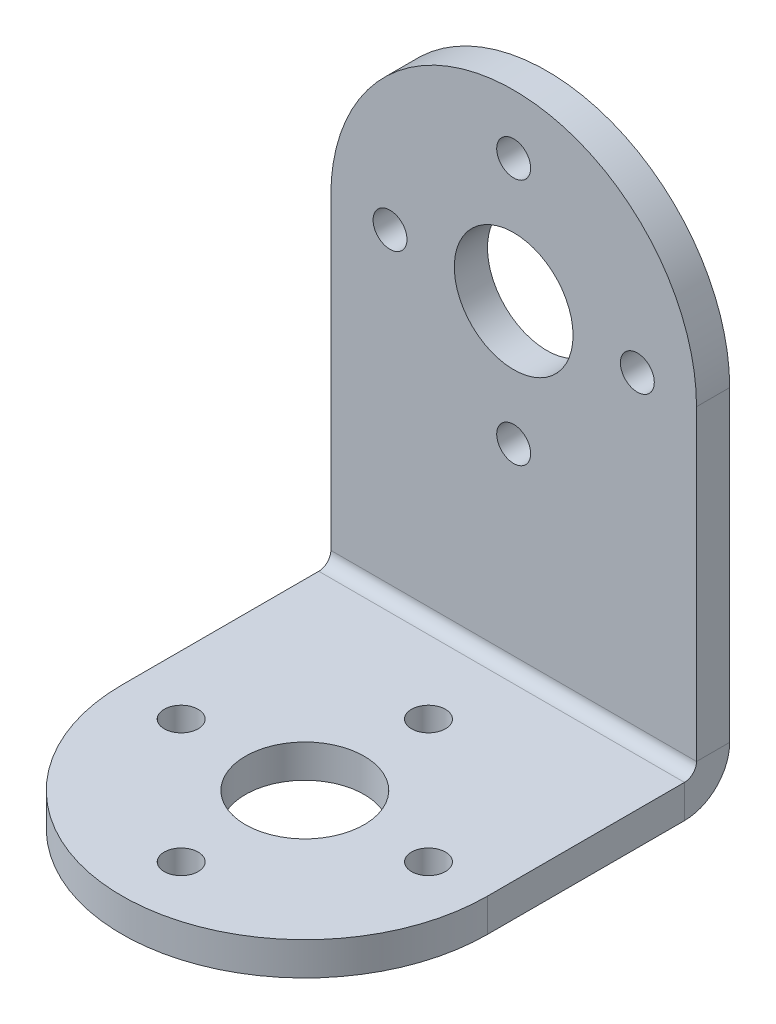
ISO-10303-21;
HEADER;
FILE_DESCRIPTION(('STEP AP214'),'2;1');
FILE_NAME('part.step','',(''),(''),'','','');
FILE_SCHEMA(('AUTOMOTIVE_DESIGN { 1 0 10303 214 1 1 1 1 }'));
ENDSEC;
DATA;
#1=APPLICATION_CONTEXT('core data for automotive mechanical design processes');
#2=APPLICATION_PROTOCOL_DEFINITION('international standard','automotive_design',2000,#1);
#3=PRODUCT_CONTEXT('',#1,'mechanical');
#4=PRODUCT('Part','Part','',(#3));
#5=PRODUCT_RELATED_PRODUCT_CATEGORY('part','',(#4));
#6=PRODUCT_DEFINITION_FORMATION('','',#4);
#7=PRODUCT_DEFINITION_CONTEXT('part definition',#1,'design');
#8=PRODUCT_DEFINITION('design','',#6,#7);
#9=PRODUCT_DEFINITION_SHAPE('','',#8);
#10=(LENGTH_UNIT() NAMED_UNIT(*) SI_UNIT(.MILLI.,.METRE.));
#11=(NAMED_UNIT(*) PLANE_ANGLE_UNIT() SI_UNIT($,.RADIAN.));
#12=(NAMED_UNIT(*) SI_UNIT($,.STERADIAN.) SOLID_ANGLE_UNIT());
#13=UNCERTAINTY_MEASURE_WITH_UNIT(LENGTH_MEASURE(1.E-05),#10,'distance_accuracy_value','');
#14=(GEOMETRIC_REPRESENTATION_CONTEXT(3) GLOBAL_UNCERTAINTY_ASSIGNED_CONTEXT((#13)) GLOBAL_UNIT_ASSIGNED_CONTEXT((#10,
#11,#12)) REPRESENTATION_CONTEXT('',''));
#15=CARTESIAN_POINT('',(0.,0.,0.));
#16=DIRECTION('',(0.,0.,1.));
#17=DIRECTION('',(1.,0.,0.));
#18=AXIS2_PLACEMENT_3D('',#15,#16,#17);
#19=CARTESIAN_POINT('',(0.,2.2352,16.3068));
#20=DIRECTION('',(0.,1.,0.));
#21=DIRECTION('',(0.,0.,1.));
#22=AXIS2_PLACEMENT_3D('',#19,#20,#21);
#23=CYLINDRICAL_SURFACE('',#22,12.319);
#24=DIRECTION('',(0.,1.,0.));
#25=VECTOR('',#24,1.);
#26=CARTESIAN_POINT('',(12.319,3.048,16.3068));
#27=LINE('',#26,#25);
#28=CARTESIAN_POINT('',(12.319,2.2352,16.3068));
#29=VERTEX_POINT('',#28);
#30=CARTESIAN_POINT('',(12.319,0.,16.3068));
#31=VERTEX_POINT('',#30);
#32=EDGE_CURVE('E136',#29,#31,#27,.F.);
#33=ORIENTED_EDGE('',*,*,#32,.F.);
#34=CARTESIAN_POINT('',(0.,2.2352,16.3068));
#35=DIRECTION('',(0.,-1.,0.));
#36=DIRECTION('',(0.,0.,-1.));
#37=AXIS2_PLACEMENT_3D('',#34,#35,#36);
#38=CIRCLE('',#37,12.319);
#39=CARTESIAN_POINT('',(-12.319,2.2352,16.3068));
#40=VERTEX_POINT('',#39);
#41=EDGE_CURVE('E50',#40,#29,#38,.F.);
#42=ORIENTED_EDGE('',*,*,#41,.F.);
#43=DIRECTION('',(0.,-1.,0.));
#44=VECTOR('',#43,1.);
#45=CARTESIAN_POINT('',(-12.319,2.2352,16.3068));
#46=LINE('',#45,#44);
#47=CARTESIAN_POINT('',(-12.319,0.,16.3068));
#48=VERTEX_POINT('',#47);
#49=EDGE_CURVE('E209',#48,#40,#46,.F.);
#50=ORIENTED_EDGE('',*,*,#49,.F.);
#51=CARTESIAN_POINT('',(0.,0.,16.3068));
#52=DIRECTION('',(0.,-1.,0.));
#53=DIRECTION('',(0.,0.,-1.));
#54=AXIS2_PLACEMENT_3D('',#51,#52,#53);
#55=CIRCLE('',#54,12.319);
#56=EDGE_CURVE('E11',#31,#48,#55,.T.);
#57=ORIENTED_EDGE('',*,*,#56,.F.);
#58=EDGE_LOOP('',(#33,#42,#50,#57));
#59=FACE_BOUND('',#58,.T.);
#60=ADVANCED_FACE('F42',(#59),#23,.T.);
#61=CARTESIAN_POINT('',(0.,23.749,0.));
#62=DIRECTION('',(0.,0.,-1.));
#63=DIRECTION('',(-1.,0.,0.));
#64=AXIS2_PLACEMENT_3D('',#61,#62,#63);
#65=CYLINDRICAL_SURFACE('',#64,12.319);
#66=DIRECTION('',(0.,0.,-1.));
#67=VECTOR('',#66,1.);
#68=CARTESIAN_POINT('',(12.319,23.749,3.048));
#69=LINE('',#68,#67);
#70=CARTESIAN_POINT('',(12.319,23.749,0.));
#71=VERTEX_POINT('',#70);
#72=CARTESIAN_POINT('',(12.319,23.749,2.2352));
#73=VERTEX_POINT('',#72);
#74=EDGE_CURVE('E118',#71,#73,#69,.F.);
#75=ORIENTED_EDGE('',*,*,#74,.F.);
#76=CARTESIAN_POINT('',(0.,23.749,0.));
#77=DIRECTION('',(0.,0.,-1.));
#78=DIRECTION('',(-1.,0.,0.));
#79=AXIS2_PLACEMENT_3D('',#76,#77,#78);
#80=CIRCLE('',#79,12.319);
#81=CARTESIAN_POINT('',(-12.319,23.749,0.));
#82=VERTEX_POINT('',#81);
#83=EDGE_CURVE('E201',#82,#71,#80,.T.);
#84=ORIENTED_EDGE('',*,*,#83,.F.);
#85=DIRECTION('',(0.,0.,-1.));
#86=VECTOR('',#85,1.);
#87=CARTESIAN_POINT('',(-12.319,23.749,3.048));
#88=LINE('',#87,#86);
#89=CARTESIAN_POINT('',(-12.319,23.749,2.2352));
#90=VERTEX_POINT('',#89);
#91=EDGE_CURVE('E197',#90,#82,#88,.T.);
#92=ORIENTED_EDGE('',*,*,#91,.F.);
#93=CARTESIAN_POINT('',(0.,23.749,2.2352));
#94=DIRECTION('',(0.,0.,-1.));
#95=DIRECTION('',(-1.,0.,0.));
#96=AXIS2_PLACEMENT_3D('',#93,#94,#95);
#97=CIRCLE('',#96,12.319);
#98=EDGE_CURVE('E204',#73,#90,#97,.F.);
#99=ORIENTED_EDGE('',*,*,#98,.F.);
#100=EDGE_LOOP('',(#75,#84,#92,#99));
#101=FACE_BOUND('',#100,.T.);
#102=ADVANCED_FACE('F337',(#101),#65,.T.);
#103=CARTESIAN_POINT('',(12.319,0.,3.048));
#104=DIRECTION('',(1.,0.,0.));
#105=DIRECTION('',(0.,0.,-1.));
#106=AXIS2_PLACEMENT_3D('',#103,#104,#105);
#107=PLANE('',#106);
#108=DIRECTION('',(0.,1.,0.));
#109=VECTOR('',#108,1.);
#110=CARTESIAN_POINT('',(12.319,0.,3.048));
#111=LINE('',#110,#109);
#112=CARTESIAN_POINT('',(12.319,0.,3.048));
#113=VERTEX_POINT('',#112);
#114=CARTESIAN_POINT('',(12.319,2.2352,3.048));
#115=VERTEX_POINT('',#114);
#116=EDGE_CURVE('E105',#113,#115,#111,.T.);
#117=ORIENTED_EDGE('',*,*,#116,.F.);
#118=CARTESIAN_POINT('',(12.319,3.048,3.048));
#119=DIRECTION('',(1.,0.,0.));
#120=DIRECTION('',(0.,0.,-1.));
#121=AXIS2_PLACEMENT_3D('',#118,#119,#120);
#122=CIRCLE('',#121,3.048);
#123=CARTESIAN_POINT('',(12.319,3.048,0.));
#124=VERTEX_POINT('',#123);
#125=EDGE_CURVE('E110',#124,#113,#122,.F.);
#126=ORIENTED_EDGE('',*,*,#125,.F.);
#127=DIRECTION('',(0.,0.,-1.));
#128=VECTOR('',#127,1.);
#129=CARTESIAN_POINT('',(12.319,3.048,2.2352));
#130=LINE('',#129,#128);
#131=CARTESIAN_POINT('',(12.319,3.048,2.2352));
#132=VERTEX_POINT('',#131);
#133=EDGE_CURVE('E119',#132,#124,#130,.T.);
#134=ORIENTED_EDGE('',*,*,#133,.F.);
#135=CARTESIAN_POINT('',(12.319,3.048,3.048));
#136=DIRECTION('',(1.,0.,0.));
#137=DIRECTION('',(0.,0.,-1.));
#138=AXIS2_PLACEMENT_3D('',#135,#136,#137);
#139=CIRCLE('',#138,0.8128);
#140=EDGE_CURVE('E112',#132,#115,#139,.F.);
#141=ORIENTED_EDGE('',*,*,#140,.T.);
#142=EDGE_LOOP('',(#117,#126,#134,#141));
#143=FACE_BOUND('',#142,.T.);
#144=ADVANCED_FACE('F107',(#143),#107,.T.);
#145=CARTESIAN_POINT('',(12.319,3.048,2.2352));
#146=DIRECTION('',(1.,0.,0.));
#147=DIRECTION('',(0.,0.,-1.));
#148=AXIS2_PLACEMENT_3D('',#145,#146,#147);
#149=PLANE('',#148);
#150=DIRECTION('',(0.,0.,1.));
#151=VECTOR('',#150,1.);
#152=CARTESIAN_POINT('',(12.319,2.2352,0.));
#153=LINE('',#152,#151);
#154=EDGE_CURVE('E138',#115,#29,#153,.T.);
#155=ORIENTED_EDGE('',*,*,#154,.T.);
#156=ORIENTED_EDGE('',*,*,#32,.T.);
#157=DIRECTION('',(0.,0.,1.));
#158=VECTOR('',#157,1.);
#159=CARTESIAN_POINT('',(12.319,0.,0.));
#160=LINE('',#159,#158);
#161=EDGE_CURVE('E124',#113,#31,#160,.T.);
#162=ORIENTED_EDGE('',*,*,#161,.F.);
#163=ORIENTED_EDGE('',*,*,#116,.T.);
#164=EDGE_LOOP('',(#155,#156,#162,#163));
#165=FACE_BOUND('',#164,.T.);
#166=ADVANCED_FACE('F135',(#165),#149,.T.);
#167=CARTESIAN_POINT('',(-12.319,3.048,0.));
#168=DIRECTION('',(-1.,0.,0.));
#169=DIRECTION('',(0.,0.,1.));
#170=AXIS2_PLACEMENT_3D('',#167,#168,#169);
#171=PLANE('',#170);
#172=DIRECTION('',(0.,0.,1.));
#173=VECTOR('',#172,1.);
#174=CARTESIAN_POINT('',(-12.319,3.048,0.));
#175=LINE('',#174,#173);
#176=CARTESIAN_POINT('',(-12.319,3.048,0.));
#177=VERTEX_POINT('',#176);
#178=CARTESIAN_POINT('',(-12.319,3.048,2.2352));
#179=VERTEX_POINT('',#178);
#180=EDGE_CURVE('E187',#177,#179,#175,.T.);
#181=ORIENTED_EDGE('',*,*,#180,.F.);
#182=CARTESIAN_POINT('',(-12.319,3.048,3.048));
#183=DIRECTION('',(1.,0.,0.));
#184=DIRECTION('',(0.,0.,-1.));
#185=AXIS2_PLACEMENT_3D('',#182,#183,#184);
#186=CIRCLE('',#185,3.048);
#187=CARTESIAN_POINT('',(-12.319,0.,3.048));
#188=VERTEX_POINT('',#187);
#189=EDGE_CURVE('E163',#177,#188,#186,.F.);
#190=ORIENTED_EDGE('',*,*,#189,.T.);
#191=DIRECTION('',(0.,-1.,0.));
#192=VECTOR('',#191,1.);
#193=CARTESIAN_POINT('',(-12.319,2.2352,3.048));
#194=LINE('',#193,#192);
#195=CARTESIAN_POINT('',(-12.319,2.2352,3.048));
#196=VERTEX_POINT('',#195);
#197=EDGE_CURVE('E131',#196,#188,#194,.T.);
#198=ORIENTED_EDGE('',*,*,#197,.F.);
#199=CARTESIAN_POINT('',(-12.319,3.048,3.048));
#200=DIRECTION('',(1.,0.,0.));
#201=DIRECTION('',(0.,0.,-1.));
#202=AXIS2_PLACEMENT_3D('',#199,#200,#201);
#203=CIRCLE('',#202,0.8128);
#204=EDGE_CURVE('E172',#179,#196,#203,.F.);
#205=ORIENTED_EDGE('',*,*,#204,.F.);
#206=EDGE_LOOP('',(#181,#190,#198,#205));
#207=FACE_BOUND('',#206,.T.);
#208=ADVANCED_FACE('F350',(#207),#171,.T.);
#209=CARTESIAN_POINT('',(-12.319,2.2352,3.048));
#210=DIRECTION('',(-1.,0.,0.));
#211=DIRECTION('',(0.,0.,1.));
#212=AXIS2_PLACEMENT_3D('',#209,#210,#211);
#213=PLANE('',#212);
#214=DIRECTION('',(0.,1.,0.));
#215=VECTOR('',#214,1.);
#216=CARTESIAN_POINT('',(-12.319,0.,2.2352));
#217=LINE('',#216,#215);
#218=EDGE_CURVE('E169',#90,#179,#217,.F.);
#219=ORIENTED_EDGE('',*,*,#218,.F.);
#220=ORIENTED_EDGE('',*,*,#91,.T.);
#221=DIRECTION('',(0.,-1.,0.));
#222=VECTOR('',#221,1.);
#223=CARTESIAN_POINT('',(-12.319,0.,0.));
#224=LINE('',#223,#222);
#225=EDGE_CURVE('E166',#82,#177,#224,.T.);
#226=ORIENTED_EDGE('',*,*,#225,.T.);
#227=ORIENTED_EDGE('',*,*,#180,.T.);
#228=EDGE_LOOP('',(#219,#220,#226,#227));
#229=FACE_BOUND('',#228,.T.);
#230=ADVANCED_FACE('F309',(#229),#213,.T.);
#231=CARTESIAN_POINT('',(12.319,2.2352,0.));
#232=DIRECTION('',(0.,-1.,0.));
#233=DIRECTION('',(0.,0.,-1.));
#234=AXIS2_PLACEMENT_3D('',#231,#232,#233);
#235=PLANE('',#234);
#236=CARTESIAN_POINT('',(-8.3312,2.2352,16.3068));
#237=DIRECTION('',(0.,1.,0.));
#238=DIRECTION('',(0.,0.,1.));
#239=AXIS2_PLACEMENT_3D('',#236,#237,#238);
#240=CIRCLE('',#239,1.143);
#241=CARTESIAN_POINT('',(-8.3312,2.2352,17.4498));
#242=VERTEX_POINT('',#241);
#243=EDGE_CURVE('E290',#242,#242,#240,.T.);
#244=ORIENTED_EDGE('',*,*,#243,.F.);
#245=EDGE_LOOP('',(#244));
#246=FACE_BOUND('',#245,.T.);
#247=CARTESIAN_POINT('',(0.,2.2352,24.638));
#248=DIRECTION('',(0.,1.,0.));
#249=DIRECTION('',(0.,0.,1.));
#250=AXIS2_PLACEMENT_3D('',#247,#248,#249);
#251=CIRCLE('',#250,1.143);
#252=CARTESIAN_POINT('',(0.,2.2352,25.781));
#253=VERTEX_POINT('',#252);
#254=EDGE_CURVE('E282',#253,#253,#251,.T.);
#255=ORIENTED_EDGE('',*,*,#254,.F.);
#256=EDGE_LOOP('',(#255));
#257=FACE_BOUND('',#256,.T.);
#258=CARTESIAN_POINT('',(8.3312,2.2352,16.3068));
#259=DIRECTION('',(0.,1.,0.));
#260=DIRECTION('',(0.,0.,1.));
#261=AXIS2_PLACEMENT_3D('',#258,#259,#260);
#262=CIRCLE('',#261,1.143);
#263=CARTESIAN_POINT('',(8.3312,2.2352,17.4498));
#264=VERTEX_POINT('',#263);
#265=EDGE_CURVE('E274',#264,#264,#262,.T.);
#266=ORIENTED_EDGE('',*,*,#265,.F.);
#267=EDGE_LOOP('',(#266));
#268=FACE_BOUND('',#267,.T.);
#269=CARTESIAN_POINT('',(0.,2.2352,7.9756));
#270=DIRECTION('',(0.,1.,0.));
#271=DIRECTION('',(0.,0.,1.));
#272=AXIS2_PLACEMENT_3D('',#269,#270,#271);
#273=CIRCLE('',#272,1.143);
#274=CARTESIAN_POINT('',(0.,2.2352,9.1186));
#275=VERTEX_POINT('',#274);
#276=EDGE_CURVE('E266',#275,#275,#273,.T.);
#277=ORIENTED_EDGE('',*,*,#276,.F.);
#278=EDGE_LOOP('',(#277));
#279=FACE_BOUND('',#278,.T.);
#280=CARTESIAN_POINT('',(0.,2.2352,16.3068));
#281=DIRECTION('',(0.,1.,0.));
#282=DIRECTION('',(0.,0.,1.));
#283=AXIS2_PLACEMENT_3D('',#280,#281,#282);
#284=CIRCLE('',#283,4.0005);
#285=CARTESIAN_POINT('',(0.,2.2352,20.3073));
#286=VERTEX_POINT('',#285);
#287=EDGE_CURVE('E258',#286,#286,#284,.T.);
#288=ORIENTED_EDGE('',*,*,#287,.F.);
#289=EDGE_LOOP('',(#288));
#290=FACE_BOUND('',#289,.T.);
#291=DIRECTION('',(0.,0.,1.));
#292=VECTOR('',#291,1.);
#293=CARTESIAN_POINT('',(-12.319,2.2352,0.));
#294=LINE('',#293,#292);
#295=EDGE_CURVE('E156',#196,#40,#294,.T.);
#296=ORIENTED_EDGE('',*,*,#295,.T.);
#297=ORIENTED_EDGE('',*,*,#41,.T.);
#298=ORIENTED_EDGE('',*,*,#154,.F.);
#299=DIRECTION('',(-1.,0.,0.));
#300=VECTOR('',#299,1.);
#301=CARTESIAN_POINT('',(12.319,2.2352,3.048));
#302=LINE('',#301,#300);
#303=EDGE_CURVE('E155',#115,#196,#302,.T.);
#304=ORIENTED_EDGE('',*,*,#303,.T.);
#305=EDGE_LOOP('',(#296,#297,#298,#304));
#306=FACE_BOUND('',#305,.T.);
#307=ADVANCED_FACE('F214',(#246,#257,#268,#279,#290,#306),#235,.F.);
#308=CARTESIAN_POINT('',(12.319,0.,0.));
#309=DIRECTION('',(0.,-1.,0.));
#310=DIRECTION('',(0.,0.,-1.));
#311=AXIS2_PLACEMENT_3D('',#308,#309,#310);
#312=PLANE('',#311);
#313=CARTESIAN_POINT('',(-8.3312,0.,16.3068));
#314=DIRECTION('',(0.,1.,0.));
#315=DIRECTION('',(0.,0.,1.));
#316=AXIS2_PLACEMENT_3D('',#313,#314,#315);
#317=CIRCLE('',#316,1.143);
#318=CARTESIAN_POINT('',(-8.3312,0.,17.4498));
#319=VERTEX_POINT('',#318);
#320=EDGE_CURVE('E286',#319,#319,#317,.T.);
#321=ORIENTED_EDGE('',*,*,#320,.T.);
#322=EDGE_LOOP('',(#321));
#323=FACE_BOUND('',#322,.T.);
#324=CARTESIAN_POINT('',(0.,0.,24.638));
#325=DIRECTION('',(0.,1.,0.));
#326=DIRECTION('',(0.,0.,1.));
#327=AXIS2_PLACEMENT_3D('',#324,#325,#326);
#328=CIRCLE('',#327,1.143);
#329=CARTESIAN_POINT('',(0.,0.,25.781));
#330=VERTEX_POINT('',#329);
#331=EDGE_CURVE('E278',#330,#330,#328,.T.);
#332=ORIENTED_EDGE('',*,*,#331,.T.);
#333=EDGE_LOOP('',(#332));
#334=FACE_BOUND('',#333,.T.);
#335=CARTESIAN_POINT('',(8.3312,0.,16.3068));
#336=DIRECTION('',(0.,1.,0.));
#337=DIRECTION('',(0.,0.,1.));
#338=AXIS2_PLACEMENT_3D('',#335,#336,#337);
#339=CIRCLE('',#338,1.143);
#340=CARTESIAN_POINT('',(8.3312,0.,17.4498));
#341=VERTEX_POINT('',#340);
#342=EDGE_CURVE('E270',#341,#341,#339,.T.);
#343=ORIENTED_EDGE('',*,*,#342,.T.);
#344=EDGE_LOOP('',(#343));
#345=FACE_BOUND('',#344,.T.);
#346=CARTESIAN_POINT('',(0.,0.,7.9756));
#347=DIRECTION('',(0.,1.,0.));
#348=DIRECTION('',(0.,0.,1.));
#349=AXIS2_PLACEMENT_3D('',#346,#347,#348);
#350=CIRCLE('',#349,1.143);
#351=CARTESIAN_POINT('',(0.,0.,9.1186));
#352=VERTEX_POINT('',#351);
#353=EDGE_CURVE('E262',#352,#352,#350,.T.);
#354=ORIENTED_EDGE('',*,*,#353,.T.);
#355=EDGE_LOOP('',(#354));
#356=FACE_BOUND('',#355,.T.);
#357=CARTESIAN_POINT('',(0.,0.,16.3068));
#358=DIRECTION('',(0.,1.,0.));
#359=DIRECTION('',(0.,0.,1.));
#360=AXIS2_PLACEMENT_3D('',#357,#358,#359);
#361=CIRCLE('',#360,4.0005);
#362=CARTESIAN_POINT('',(0.,0.,20.3073));
#363=VERTEX_POINT('',#362);
#364=EDGE_CURVE('E254',#363,#363,#361,.T.);
#365=ORIENTED_EDGE('',*,*,#364,.T.);
#366=EDGE_LOOP('',(#365));
#367=FACE_BOUND('',#366,.T.);
#368=ORIENTED_EDGE('',*,*,#161,.T.);
#369=ORIENTED_EDGE('',*,*,#56,.T.);
#370=DIRECTION('',(0.,0.,1.));
#371=VECTOR('',#370,1.);
#372=CARTESIAN_POINT('',(-12.319,0.,0.));
#373=LINE('',#372,#371);
#374=EDGE_CURVE('E126',#188,#48,#373,.T.);
#375=ORIENTED_EDGE('',*,*,#374,.F.);
#376=DIRECTION('',(-1.,0.,0.));
#377=VECTOR('',#376,1.);
#378=CARTESIAN_POINT('',(12.319,0.,3.048));
#379=LINE('',#378,#377);
#380=EDGE_CURVE('E122',#113,#188,#379,.T.);
#381=ORIENTED_EDGE('',*,*,#380,.F.);
#382=EDGE_LOOP('',(#368,#369,#375,#381));
#383=FACE_BOUND('',#382,.T.);
#384=ADVANCED_FACE('F123',(#323,#334,#345,#356,#367,#383),#312,.T.);
#385=CARTESIAN_POINT('',(12.319,3.048,3.048));
#386=DIRECTION('',(-1.,0.,0.));
#387=DIRECTION('',(0.,0.,1.));
#388=AXIS2_PLACEMENT_3D('',#385,#386,#387);
#389=CYLINDRICAL_SURFACE('',#388,3.048);
#390=ORIENTED_EDGE('',*,*,#189,.F.);
#391=DIRECTION('',(-1.,0.,0.));
#392=VECTOR('',#391,1.);
#393=CARTESIAN_POINT('',(12.319,3.048,0.));
#394=LINE('',#393,#392);
#395=EDGE_CURVE('E132',#124,#177,#394,.T.);
#396=ORIENTED_EDGE('',*,*,#395,.F.);
#397=ORIENTED_EDGE('',*,*,#125,.T.);
#398=ORIENTED_EDGE('',*,*,#380,.T.);
#399=EDGE_LOOP('',(#390,#396,#397,#398));
#400=FACE_BOUND('',#399,.T.);
#401=ADVANCED_FACE('F141',(#400),#389,.T.);
#402=CARTESIAN_POINT('',(12.319,0.,0.));
#403=DIRECTION('',(0.,0.,-1.));
#404=DIRECTION('',(-1.,0.,0.));
#405=AXIS2_PLACEMENT_3D('',#402,#403,#404);
#406=PLANE('',#405);
#407=CARTESIAN_POINT('',(-8.3312,23.749,0.));
#408=DIRECTION('',(0.,0.,1.));
#409=DIRECTION('',(1.,0.,0.));
#410=AXIS2_PLACEMENT_3D('',#407,#408,#409);
#411=CIRCLE('',#410,1.143);
#412=CARTESIAN_POINT('',(-7.1882,23.749,0.));
#413=VERTEX_POINT('',#412);
#414=EDGE_CURVE('E246',#413,#413,#411,.T.);
#415=ORIENTED_EDGE('',*,*,#414,.T.);
#416=EDGE_LOOP('',(#415));
#417=FACE_BOUND('',#416,.T.);
#418=CARTESIAN_POINT('',(0.,15.4178,0.));
#419=DIRECTION('',(0.,0.,1.));
#420=DIRECTION('',(1.,0.,0.));
#421=AXIS2_PLACEMENT_3D('',#418,#419,#420);
#422=CIRCLE('',#421,1.143);
#423=CARTESIAN_POINT('',(1.143,15.4178,0.));
#424=VERTEX_POINT('',#423);
#425=EDGE_CURVE('E238',#424,#424,#422,.T.);
#426=ORIENTED_EDGE('',*,*,#425,.T.);
#427=EDGE_LOOP('',(#426));
#428=FACE_BOUND('',#427,.T.);
#429=CARTESIAN_POINT('',(8.3312,23.749,0.));
#430=DIRECTION('',(0.,0.,1.));
#431=DIRECTION('',(1.,0.,0.));
#432=AXIS2_PLACEMENT_3D('',#429,#430,#431);
#433=CIRCLE('',#432,1.143);
#434=CARTESIAN_POINT('',(9.4742,23.749,0.));
#435=VERTEX_POINT('',#434);
#436=EDGE_CURVE('E230',#435,#435,#433,.T.);
#437=ORIENTED_EDGE('',*,*,#436,.T.);
#438=EDGE_LOOP('',(#437));
#439=FACE_BOUND('',#438,.T.);
#440=CARTESIAN_POINT('',(0.,32.0802,0.));
#441=DIRECTION('',(0.,0.,1.));
#442=DIRECTION('',(1.,0.,0.));
#443=AXIS2_PLACEMENT_3D('',#440,#441,#442);
#444=CIRCLE('',#443,1.143);
#445=CARTESIAN_POINT('',(1.143,32.0802,0.));
#446=VERTEX_POINT('',#445);
#447=EDGE_CURVE('E222',#446,#446,#444,.T.);
#448=ORIENTED_EDGE('',*,*,#447,.T.);
#449=EDGE_LOOP('',(#448));
#450=FACE_BOUND('',#449,.T.);
#451=CARTESIAN_POINT('',(0.,23.749,0.));
#452=DIRECTION('',(0.,0.,1.));
#453=DIRECTION('',(1.,0.,0.));
#454=AXIS2_PLACEMENT_3D('',#451,#452,#453);
#455=CIRCLE('',#454,4.0005);
#456=CARTESIAN_POINT('',(4.0005,23.749,0.));
#457=VERTEX_POINT('',#456);
#458=EDGE_CURVE('E160',#457,#457,#455,.T.);
#459=ORIENTED_EDGE('',*,*,#458,.T.);
#460=EDGE_LOOP('',(#459));
#461=FACE_BOUND('',#460,.T.);
#462=ORIENTED_EDGE('',*,*,#225,.F.);
#463=ORIENTED_EDGE('',*,*,#83,.T.);
#464=DIRECTION('',(0.,-1.,0.));
#465=VECTOR('',#464,1.);
#466=CARTESIAN_POINT('',(12.319,0.,0.));
#467=LINE('',#466,#465);
#468=EDGE_CURVE('E144',#71,#124,#467,.T.);
#469=ORIENTED_EDGE('',*,*,#468,.T.);
#470=ORIENTED_EDGE('',*,*,#395,.T.);
#471=EDGE_LOOP('',(#462,#463,#469,#470));
#472=FACE_BOUND('',#471,.T.);
#473=ADVANCED_FACE('F361',(#417,#428,#439,#450,#461,#472),#406,.T.);
#474=CARTESIAN_POINT('',(12.319,0.,2.2352));
#475=DIRECTION('',(0.,0.,-1.));
#476=DIRECTION('',(-1.,0.,0.));
#477=AXIS2_PLACEMENT_3D('',#474,#475,#476);
#478=PLANE('',#477);
#479=CARTESIAN_POINT('',(-8.3312,23.749,2.2352));
#480=DIRECTION('',(0.,0.,1.));
#481=DIRECTION('',(1.,0.,0.));
#482=AXIS2_PLACEMENT_3D('',#479,#480,#481);
#483=CIRCLE('',#482,1.143);
#484=CARTESIAN_POINT('',(-7.1882,23.749,2.2352));
#485=VERTEX_POINT('',#484);
#486=EDGE_CURVE('E250',#485,#485,#483,.T.);
#487=ORIENTED_EDGE('',*,*,#486,.F.);
#488=EDGE_LOOP('',(#487));
#489=FACE_BOUND('',#488,.T.);
#490=CARTESIAN_POINT('',(0.,15.4178,2.2352));
#491=DIRECTION('',(0.,0.,1.));
#492=DIRECTION('',(1.,0.,0.));
#493=AXIS2_PLACEMENT_3D('',#490,#491,#492);
#494=CIRCLE('',#493,1.143);
#495=CARTESIAN_POINT('',(1.143,15.4178,2.2352));
#496=VERTEX_POINT('',#495);
#497=EDGE_CURVE('E242',#496,#496,#494,.T.);
#498=ORIENTED_EDGE('',*,*,#497,.F.);
#499=EDGE_LOOP('',(#498));
#500=FACE_BOUND('',#499,.T.);
#501=CARTESIAN_POINT('',(8.3312,23.749,2.2352));
#502=DIRECTION('',(0.,0.,1.));
#503=DIRECTION('',(1.,0.,0.));
#504=AXIS2_PLACEMENT_3D('',#501,#502,#503);
#505=CIRCLE('',#504,1.143);
#506=CARTESIAN_POINT('',(9.4742,23.749,2.2352));
#507=VERTEX_POINT('',#506);
#508=EDGE_CURVE('E234',#507,#507,#505,.T.);
#509=ORIENTED_EDGE('',*,*,#508,.F.);
#510=EDGE_LOOP('',(#509));
#511=FACE_BOUND('',#510,.T.);
#512=CARTESIAN_POINT('',(0.,32.0802,2.2352));
#513=DIRECTION('',(0.,0.,1.));
#514=DIRECTION('',(1.,0.,0.));
#515=AXIS2_PLACEMENT_3D('',#512,#513,#514);
#516=CIRCLE('',#515,1.143);
#517=CARTESIAN_POINT('',(1.143,32.0802,2.2352));
#518=VERTEX_POINT('',#517);
#519=EDGE_CURVE('E226',#518,#518,#516,.T.);
#520=ORIENTED_EDGE('',*,*,#519,.F.);
#521=EDGE_LOOP('',(#520));
#522=FACE_BOUND('',#521,.T.);
#523=CARTESIAN_POINT('',(0.,23.749,2.2352));
#524=DIRECTION('',(0.,0.,1.));
#525=DIRECTION('',(1.,0.,0.));
#526=AXIS2_PLACEMENT_3D('',#523,#524,#525);
#527=CIRCLE('',#526,4.0005);
#528=CARTESIAN_POINT('',(4.0005,23.749,2.2352));
#529=VERTEX_POINT('',#528);
#530=EDGE_CURVE('E218',#529,#529,#527,.T.);
#531=ORIENTED_EDGE('',*,*,#530,.F.);
#532=EDGE_LOOP('',(#531));
#533=FACE_BOUND('',#532,.T.);
#534=DIRECTION('',(0.,1.,0.));
#535=VECTOR('',#534,1.);
#536=CARTESIAN_POINT('',(12.319,0.,2.2352));
#537=LINE('',#536,#535);
#538=EDGE_CURVE('E147',#73,#132,#537,.F.);
#539=ORIENTED_EDGE('',*,*,#538,.F.);
#540=ORIENTED_EDGE('',*,*,#98,.T.);
#541=ORIENTED_EDGE('',*,*,#218,.T.);
#542=DIRECTION('',(-1.,0.,0.));
#543=VECTOR('',#542,1.);
#544=CARTESIAN_POINT('',(12.319,3.048,2.2352));
#545=LINE('',#544,#543);
#546=EDGE_CURVE('E179',#132,#179,#545,.T.);
#547=ORIENTED_EDGE('',*,*,#546,.F.);
#548=EDGE_LOOP('',(#539,#540,#541,#547));
#549=FACE_BOUND('',#548,.T.);
#550=ADVANCED_FACE('F364',(#489,#500,#511,#522,#533,#549),#478,.F.);
#551=CARTESIAN_POINT('',(12.319,3.048,3.048));
#552=DIRECTION('',(-1.,0.,0.));
#553=DIRECTION('',(0.,0.,1.));
#554=AXIS2_PLACEMENT_3D('',#551,#552,#553);
#555=CYLINDRICAL_SURFACE('',#554,0.8128);
#556=ORIENTED_EDGE('',*,*,#204,.T.);
#557=ORIENTED_EDGE('',*,*,#303,.F.);
#558=ORIENTED_EDGE('',*,*,#140,.F.);
#559=ORIENTED_EDGE('',*,*,#546,.T.);
#560=EDGE_LOOP('',(#556,#557,#558,#559));
#561=FACE_BOUND('',#560,.T.);
#562=ADVANCED_FACE('F368',(#561),#555,.F.);
#563=CARTESIAN_POINT('',(12.319,3.048,3.048));
#564=DIRECTION('',(1.,0.,0.));
#565=DIRECTION('',(0.,0.,-1.));
#566=AXIS2_PLACEMENT_3D('',#563,#564,#565);
#567=PLANE('',#566);
#568=ORIENTED_EDGE('',*,*,#468,.F.);
#569=ORIENTED_EDGE('',*,*,#74,.T.);
#570=ORIENTED_EDGE('',*,*,#538,.T.);
#571=ORIENTED_EDGE('',*,*,#133,.T.);
#572=EDGE_LOOP('',(#568,#569,#570,#571));
#573=FACE_BOUND('',#572,.T.);
#574=ADVANCED_FACE('F372',(#573),#567,.T.);
#575=CARTESIAN_POINT('',(-12.319,3.048,3.048));
#576=DIRECTION('',(1.,0.,0.));
#577=DIRECTION('',(0.,0.,-1.));
#578=AXIS2_PLACEMENT_3D('',#575,#576,#577);
#579=PLANE('',#578);
#580=ORIENTED_EDGE('',*,*,#374,.T.);
#581=ORIENTED_EDGE('',*,*,#49,.T.);
#582=ORIENTED_EDGE('',*,*,#295,.F.);
#583=ORIENTED_EDGE('',*,*,#197,.T.);
#584=EDGE_LOOP('',(#580,#581,#582,#583));
#585=FACE_BOUND('',#584,.T.);
#586=ADVANCED_FACE('F374',(#585),#579,.F.);
#587=CARTESIAN_POINT('',(0.,23.749,0.));
#588=DIRECTION('',(0.,0.,1.));
#589=DIRECTION('',(1.,0.,0.));
#590=AXIS2_PLACEMENT_3D('',#587,#588,#589);
#591=CYLINDRICAL_SURFACE('',#590,4.0005);
#592=ORIENTED_EDGE('',*,*,#458,.F.);
#593=EDGE_LOOP('',(#592));
#594=FACE_BOUND('',#593,.T.);
#595=ORIENTED_EDGE('',*,*,#530,.T.);
#596=EDGE_LOOP('',(#595));
#597=FACE_BOUND('',#596,.T.);
#598=ADVANCED_FACE('F377',(#594,#597),#591,.F.);
#599=CARTESIAN_POINT('',(0.,32.0802,0.));
#600=DIRECTION('',(0.,0.,1.));
#601=DIRECTION('',(1.,0.,0.));
#602=AXIS2_PLACEMENT_3D('',#599,#600,#601);
#603=CYLINDRICAL_SURFACE('',#602,1.143);
#604=ORIENTED_EDGE('',*,*,#447,.F.);
#605=EDGE_LOOP('',(#604));
#606=FACE_BOUND('',#605,.T.);
#607=ORIENTED_EDGE('',*,*,#519,.T.);
#608=EDGE_LOOP('',(#607));
#609=FACE_BOUND('',#608,.T.);
#610=ADVANCED_FACE('F384',(#606,#609),#603,.F.);
#611=CARTESIAN_POINT('',(8.3312,23.749,0.));
#612=DIRECTION('',(0.,0.,1.));
#613=DIRECTION('',(1.,0.,0.));
#614=AXIS2_PLACEMENT_3D('',#611,#612,#613);
#615=CYLINDRICAL_SURFACE('',#614,1.143);
#616=ORIENTED_EDGE('',*,*,#436,.F.);
#617=EDGE_LOOP('',(#616));
#618=FACE_BOUND('',#617,.T.);
#619=ORIENTED_EDGE('',*,*,#508,.T.);
#620=EDGE_LOOP('',(#619));
#621=FACE_BOUND('',#620,.T.);
#622=ADVANCED_FACE('F388',(#618,#621),#615,.F.);
#623=CARTESIAN_POINT('',(0.,15.4178,0.));
#624=DIRECTION('',(0.,0.,1.));
#625=DIRECTION('',(1.,0.,0.));
#626=AXIS2_PLACEMENT_3D('',#623,#624,#625);
#627=CYLINDRICAL_SURFACE('',#626,1.143);
#628=ORIENTED_EDGE('',*,*,#425,.F.);
#629=EDGE_LOOP('',(#628));
#630=FACE_BOUND('',#629,.T.);
#631=ORIENTED_EDGE('',*,*,#497,.T.);
#632=EDGE_LOOP('',(#631));
#633=FACE_BOUND('',#632,.T.);
#634=ADVANCED_FACE('F332',(#630,#633),#627,.F.);
#635=CARTESIAN_POINT('',(-8.3312,23.749,0.));
#636=DIRECTION('',(0.,0.,1.));
#637=DIRECTION('',(1.,0.,0.));
#638=AXIS2_PLACEMENT_3D('',#635,#636,#637);
#639=CYLINDRICAL_SURFACE('',#638,1.143);
#640=ORIENTED_EDGE('',*,*,#414,.F.);
#641=EDGE_LOOP('',(#640));
#642=FACE_BOUND('',#641,.T.);
#643=ORIENTED_EDGE('',*,*,#486,.T.);
#644=EDGE_LOOP('',(#643));
#645=FACE_BOUND('',#644,.T.);
#646=ADVANCED_FACE('F322',(#642,#645),#639,.F.);
#647=CARTESIAN_POINT('',(0.,0.,16.3068));
#648=DIRECTION('',(0.,1.,0.));
#649=DIRECTION('',(0.,0.,1.));
#650=AXIS2_PLACEMENT_3D('',#647,#648,#649);
#651=CYLINDRICAL_SURFACE('',#650,4.0005);
#652=ORIENTED_EDGE('',*,*,#364,.F.);
#653=EDGE_LOOP('',(#652));
#654=FACE_BOUND('',#653,.T.);
#655=ORIENTED_EDGE('',*,*,#287,.T.);
#656=EDGE_LOOP('',(#655));
#657=FACE_BOUND('',#656,.T.);
#658=ADVANCED_FACE('F319',(#654,#657),#651,.F.);
#659=CARTESIAN_POINT('',(0.,0.,7.9756));
#660=DIRECTION('',(0.,1.,0.));
#661=DIRECTION('',(0.,0.,1.));
#662=AXIS2_PLACEMENT_3D('',#659,#660,#661);
#663=CYLINDRICAL_SURFACE('',#662,1.143);
#664=ORIENTED_EDGE('',*,*,#353,.F.);
#665=EDGE_LOOP('',(#664));
#666=FACE_BOUND('',#665,.T.);
#667=ORIENTED_EDGE('',*,*,#276,.T.);
#668=EDGE_LOOP('',(#667));
#669=FACE_BOUND('',#668,.T.);
#670=ADVANCED_FACE('F321',(#666,#669),#663,.F.);
#671=CARTESIAN_POINT('',(8.3312,0.,16.3068));
#672=DIRECTION('',(0.,1.,0.));
#673=DIRECTION('',(0.,0.,1.));
#674=AXIS2_PLACEMENT_3D('',#671,#672,#673);
#675=CYLINDRICAL_SURFACE('',#674,1.143);
#676=ORIENTED_EDGE('',*,*,#342,.F.);
#677=EDGE_LOOP('',(#676));
#678=FACE_BOUND('',#677,.T.);
#679=ORIENTED_EDGE('',*,*,#265,.T.);
#680=EDGE_LOOP('',(#679));
#681=FACE_BOUND('',#680,.T.);
#682=ADVANCED_FACE('F329',(#678,#681),#675,.F.);
#683=CARTESIAN_POINT('',(0.,0.,24.638));
#684=DIRECTION('',(0.,1.,0.));
#685=DIRECTION('',(0.,0.,1.));
#686=AXIS2_PLACEMENT_3D('',#683,#684,#685);
#687=CYLINDRICAL_SURFACE('',#686,1.143);
#688=ORIENTED_EDGE('',*,*,#331,.F.);
#689=EDGE_LOOP('',(#688));
#690=FACE_BOUND('',#689,.T.);
#691=ORIENTED_EDGE('',*,*,#254,.T.);
#692=EDGE_LOOP('',(#691));
#693=FACE_BOUND('',#692,.T.);
#694=ADVANCED_FACE('F303',(#690,#693),#687,.F.);
#695=CARTESIAN_POINT('',(-8.3312,0.,16.3068));
#696=DIRECTION('',(0.,1.,0.));
#697=DIRECTION('',(0.,0.,1.));
#698=AXIS2_PLACEMENT_3D('',#695,#696,#697);
#699=CYLINDRICAL_SURFACE('',#698,1.143);
#700=ORIENTED_EDGE('',*,*,#320,.F.);
#701=EDGE_LOOP('',(#700));
#702=FACE_BOUND('',#701,.T.);
#703=ORIENTED_EDGE('',*,*,#243,.T.);
#704=EDGE_LOOP('',(#703));
#705=FACE_BOUND('',#704,.T.);
#706=ADVANCED_FACE('F300',(#702,#705),#699,.F.);
#707=CLOSED_SHELL('',(#60,#102,#144,#166,#208,#230,#307,#384,#401,#473,#550,#562,#574,#586,#598,
#610,#622,#634,#646,#658,#670,#682,#694,#706));
#708=MANIFOLD_SOLID_BREP('B2',#707);
#709=ADVANCED_BREP_SHAPE_REPRESENTATION('',(#18,#708),#14);
#710=SHAPE_DEFINITION_REPRESENTATION(#9,#709);
ENDSEC;
END-ISO-10303-21;
